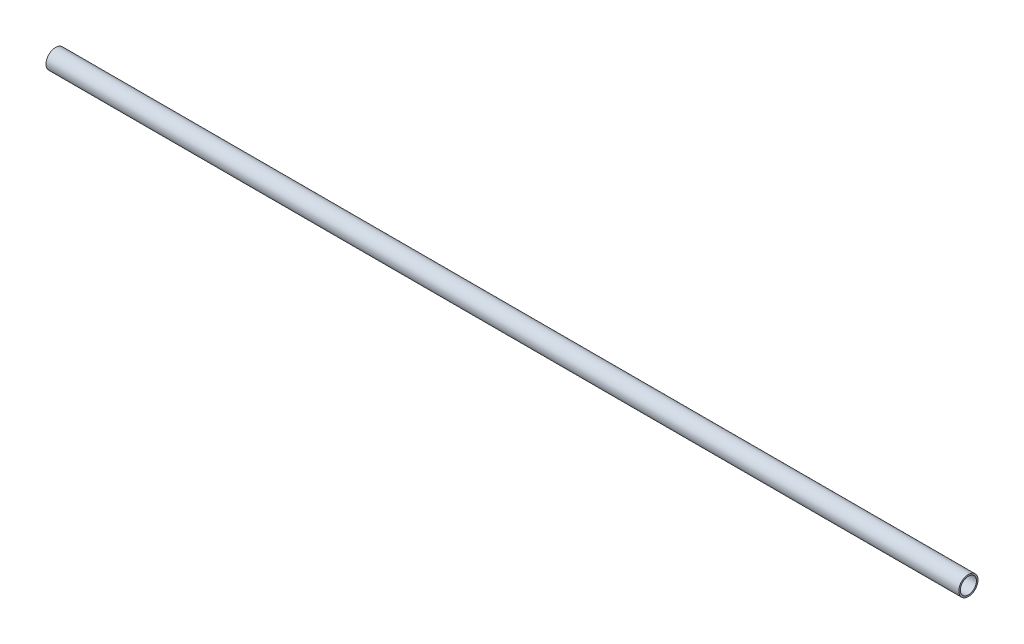
ISO-10303-21;
HEADER;
FILE_DESCRIPTION(('STEP AP214'),'2;1');
FILE_NAME('part.step','',(''),(''),'','','');
FILE_SCHEMA(('AUTOMOTIVE_DESIGN { 1 0 10303 214 1 1 1 1 }'));
ENDSEC;
DATA;
#1=APPLICATION_CONTEXT('core data for automotive mechanical design processes');
#2=APPLICATION_PROTOCOL_DEFINITION('international standard','automotive_design',2000,#1);
#3=PRODUCT_CONTEXT('',#1,'mechanical');
#4=PRODUCT('Part','Part','',(#3));
#5=PRODUCT_RELATED_PRODUCT_CATEGORY('part','',(#4));
#6=PRODUCT_DEFINITION_FORMATION('','',#4);
#7=PRODUCT_DEFINITION_CONTEXT('part definition',#1,'design');
#8=PRODUCT_DEFINITION('design','',#6,#7);
#9=PRODUCT_DEFINITION_SHAPE('','',#8);
#10=(LENGTH_UNIT() NAMED_UNIT(*) SI_UNIT(.MILLI.,.METRE.));
#11=(NAMED_UNIT(*) PLANE_ANGLE_UNIT() SI_UNIT($,.RADIAN.));
#12=(NAMED_UNIT(*) SI_UNIT($,.STERADIAN.) SOLID_ANGLE_UNIT());
#13=UNCERTAINTY_MEASURE_WITH_UNIT(LENGTH_MEASURE(1.E-05),#10,'distance_accuracy_value','');
#14=(GEOMETRIC_REPRESENTATION_CONTEXT(3) GLOBAL_UNCERTAINTY_ASSIGNED_CONTEXT((#13)) GLOBAL_UNIT_ASSIGNED_CONTEXT((#10,
#11,#12)) REPRESENTATION_CONTEXT('',''));
#15=CARTESIAN_POINT('',(0.,0.,0.));
#16=DIRECTION('',(0.,0.,1.));
#17=DIRECTION('',(1.,0.,0.));
#18=AXIS2_PLACEMENT_3D('',#15,#16,#17);
#19=CARTESIAN_POINT('',(-301.625,0.,0.));
#20=DIRECTION('',(1.,0.,0.));
#21=DIRECTION('',(0.,0.,-1.));
#22=AXIS2_PLACEMENT_3D('',#19,#20,#21);
#23=CYLINDRICAL_SURFACE('',#22,3.175);
#24=CARTESIAN_POINT('',(-301.625,0.,0.));
#25=DIRECTION('',(1.,0.,0.));
#26=DIRECTION('',(0.,0.,-1.));
#27=AXIS2_PLACEMENT_3D('',#24,#25,#26);
#28=CIRCLE('',#27,3.175);
#29=CARTESIAN_POINT('',(-301.625,0.,-3.175));
#30=VERTEX_POINT('',#29);
#31=EDGE_CURVE('E10',#30,#30,#28,.T.);
#32=ORIENTED_EDGE('',*,*,#31,.T.);
#33=EDGE_LOOP('',(#32));
#34=FACE_BOUND('',#33,.T.);
#35=CARTESIAN_POINT('',(0.,0.,0.));
#36=DIRECTION('',(1.,0.,0.));
#37=DIRECTION('',(0.,0.,-1.));
#38=AXIS2_PLACEMENT_3D('',#35,#36,#37);
#39=CIRCLE('',#38,3.175);
#40=CARTESIAN_POINT('',(0.,0.,-3.175));
#41=VERTEX_POINT('',#40);
#42=EDGE_CURVE('E46',#41,#41,#39,.T.);
#43=ORIENTED_EDGE('',*,*,#42,.F.);
#44=EDGE_LOOP('',(#43));
#45=FACE_BOUND('',#44,.T.);
#46=ADVANCED_FACE('F43',(#34,#45),#23,.T.);
#47=CARTESIAN_POINT('',(-301.625,0.,0.));
#48=DIRECTION('',(1.,0.,0.));
#49=DIRECTION('',(0.,0.,-1.));
#50=AXIS2_PLACEMENT_3D('',#47,#48,#49);
#51=PLANE('',#50);
#52=CARTESIAN_POINT('',(-301.625,0.,0.));
#53=DIRECTION('',(1.,0.,0.));
#54=DIRECTION('',(0.,0.,-1.));
#55=AXIS2_PLACEMENT_3D('',#52,#53,#54);
#56=CIRCLE('',#55,2.667);
#57=CARTESIAN_POINT('',(-301.625,0.,-2.667));
#58=VERTEX_POINT('',#57);
#59=EDGE_CURVE('E53',#58,#58,#56,.T.);
#60=ORIENTED_EDGE('',*,*,#59,.T.);
#61=EDGE_LOOP('',(#60));
#62=FACE_BOUND('',#61,.T.);
#63=ORIENTED_EDGE('',*,*,#31,.F.);
#64=EDGE_LOOP('',(#63));
#65=FACE_BOUND('',#64,.T.);
#66=ADVANCED_FACE('F61',(#62,#65),#51,.F.);
#67=CARTESIAN_POINT('',(0.,0.,0.));
#68=DIRECTION('',(1.,0.,0.));
#69=DIRECTION('',(0.,0.,-1.));
#70=AXIS2_PLACEMENT_3D('',#67,#68,#69);
#71=PLANE('',#70);
#72=CARTESIAN_POINT('',(0.,0.,0.));
#73=DIRECTION('',(1.,0.,0.));
#74=DIRECTION('',(0.,0.,-1.));
#75=AXIS2_PLACEMENT_3D('',#72,#73,#74);
#76=CIRCLE('',#75,2.667);
#77=CARTESIAN_POINT('',(0.,0.,-2.667));
#78=VERTEX_POINT('',#77);
#79=EDGE_CURVE('E55',#78,#78,#76,.T.);
#80=ORIENTED_EDGE('',*,*,#79,.F.);
#81=EDGE_LOOP('',(#80));
#82=FACE_BOUND('',#81,.T.);
#83=ORIENTED_EDGE('',*,*,#42,.T.);
#84=EDGE_LOOP('',(#83));
#85=FACE_BOUND('',#84,.T.);
#86=ADVANCED_FACE('F67',(#82,#85),#71,.T.);
#87=CARTESIAN_POINT('',(-301.625,0.,0.));
#88=DIRECTION('',(1.,0.,0.));
#89=DIRECTION('',(0.,0.,-1.));
#90=AXIS2_PLACEMENT_3D('',#87,#88,#89);
#91=CYLINDRICAL_SURFACE('',#90,2.667);
#92=ORIENTED_EDGE('',*,*,#59,.F.);
#93=EDGE_LOOP('',(#92));
#94=FACE_BOUND('',#93,.T.);
#95=ORIENTED_EDGE('',*,*,#79,.T.);
#96=EDGE_LOOP('',(#95));
#97=FACE_BOUND('',#96,.T.);
#98=ADVANCED_FACE('F64',(#94,#97),#91,.F.);
#99=CLOSED_SHELL('',(#46,#66,#86,#98));
#100=MANIFOLD_SOLID_BREP('B2',#99);
#101=ADVANCED_BREP_SHAPE_REPRESENTATION('',(#18,#100),#14);
#102=SHAPE_DEFINITION_REPRESENTATION(#9,#101);
ENDSEC;
END-ISO-10303-21;
